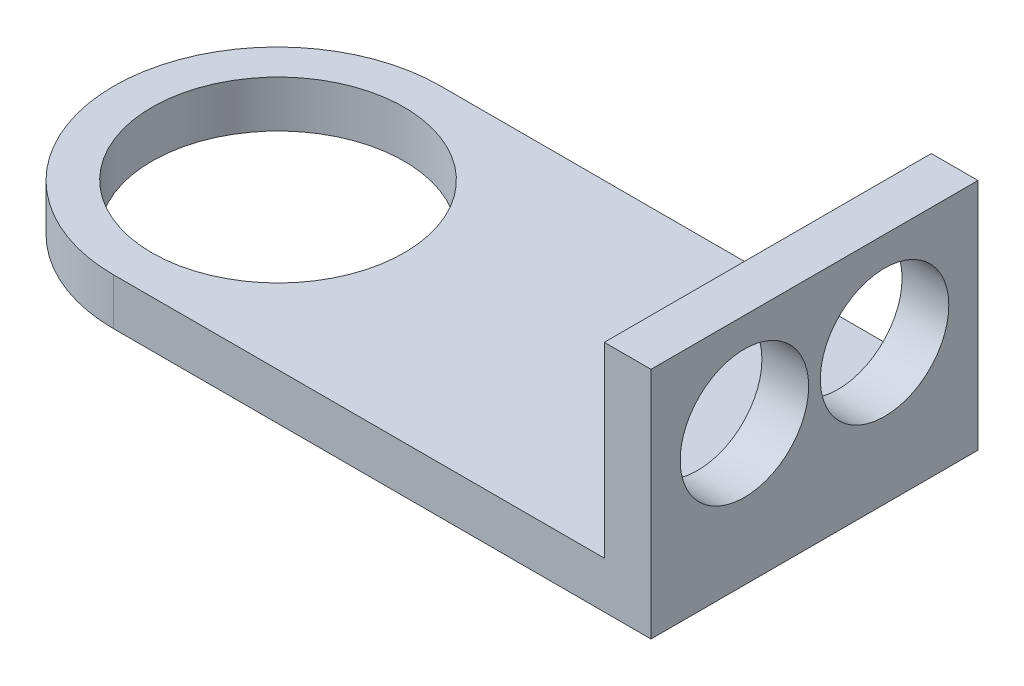
ISO-10303-21;
HEADER;
FILE_DESCRIPTION(('STEP AP214'),'2;1');
FILE_NAME('part.step','',(''),(''),'','','');
FILE_SCHEMA(('AUTOMOTIVE_DESIGN { 1 0 10303 214 1 1 1 1 }'));
ENDSEC;
DATA;
#1=APPLICATION_CONTEXT('core data for automotive mechanical design processes');
#2=APPLICATION_PROTOCOL_DEFINITION('international standard','automotive_design',2000,#1);
#3=PRODUCT_CONTEXT('',#1,'mechanical');
#4=PRODUCT('Part','Part','',(#3));
#5=PRODUCT_RELATED_PRODUCT_CATEGORY('part','',(#4));
#6=PRODUCT_DEFINITION_FORMATION('','',#4);
#7=PRODUCT_DEFINITION_CONTEXT('part definition',#1,'design');
#8=PRODUCT_DEFINITION('design','',#6,#7);
#9=PRODUCT_DEFINITION_SHAPE('','',#8);
#10=(LENGTH_UNIT() NAMED_UNIT(*) SI_UNIT(.MILLI.,.METRE.));
#11=(NAMED_UNIT(*) PLANE_ANGLE_UNIT() SI_UNIT($,.RADIAN.));
#12=(NAMED_UNIT(*) SI_UNIT($,.STERADIAN.) SOLID_ANGLE_UNIT());
#13=UNCERTAINTY_MEASURE_WITH_UNIT(LENGTH_MEASURE(1.E-05),#10,'distance_accuracy_value','');
#14=(GEOMETRIC_REPRESENTATION_CONTEXT(3) GLOBAL_UNCERTAINTY_ASSIGNED_CONTEXT((#13)) GLOBAL_UNIT_ASSIGNED_CONTEXT((#10,
#11,#12)) REPRESENTATION_CONTEXT('',''));
#15=CARTESIAN_POINT('',(0.,0.,0.));
#16=DIRECTION('',(0.,0.,1.));
#17=DIRECTION('',(1.,0.,0.));
#18=AXIS2_PLACEMENT_3D('',#15,#16,#17);
#19=CARTESIAN_POINT('',(-11.5,1.,-3.5));
#20=DIRECTION('',(0.,-1.,0.));
#21=DIRECTION('',(0.,0.,-1.));
#22=AXIS2_PLACEMENT_3D('',#19,#20,#21);
#23=CYLINDRICAL_SURFACE('',#22,3.5);
#24=DIRECTION('',(0.,-1.,0.));
#25=VECTOR('',#24,1.);
#26=CARTESIAN_POINT('',(-11.5,1.,0.));
#27=LINE('',#26,#25);
#28=CARTESIAN_POINT('',(-11.5,1.,0.));
#29=VERTEX_POINT('',#28);
#30=CARTESIAN_POINT('',(-11.5,0.,0.));
#31=VERTEX_POINT('',#30);
#32=EDGE_CURVE('E141',#29,#31,#27,.T.);
#33=ORIENTED_EDGE('',*,*,#32,.F.);
#34=CARTESIAN_POINT('',(-11.5,1.,-3.5));
#35=DIRECTION('',(0.,1.,0.));
#36=DIRECTION('',(0.,0.,1.));
#37=AXIS2_PLACEMENT_3D('',#34,#35,#36);
#38=CIRCLE('',#37,3.5);
#39=CARTESIAN_POINT('',(-11.5,1.,-7.));
#40=VERTEX_POINT('',#39);
#41=EDGE_CURVE('E44',#40,#29,#38,.T.);
#42=ORIENTED_EDGE('',*,*,#41,.F.);
#43=DIRECTION('',(0.,-1.,0.));
#44=VECTOR('',#43,1.);
#45=CARTESIAN_POINT('',(-11.5,1.,-7.));
#46=LINE('',#45,#44);
#47=CARTESIAN_POINT('',(-11.5,0.,-7.));
#48=VERTEX_POINT('',#47);
#49=EDGE_CURVE('E144',#48,#40,#46,.F.);
#50=ORIENTED_EDGE('',*,*,#49,.F.);
#51=CARTESIAN_POINT('',(-11.5,0.,-3.5));
#52=DIRECTION('',(0.,1.,0.));
#53=DIRECTION('',(0.,0.,1.));
#54=AXIS2_PLACEMENT_3D('',#51,#52,#53);
#55=CIRCLE('',#54,3.5);
#56=EDGE_CURVE('E11',#31,#48,#55,.F.);
#57=ORIENTED_EDGE('',*,*,#56,.F.);
#58=EDGE_LOOP('',(#33,#42,#50,#57));
#59=FACE_BOUND('',#58,.T.);
#60=ADVANCED_FACE('F35',(#59),#23,.T.);
#61=CARTESIAN_POINT('',(-15.,1.,0.));
#62=DIRECTION('',(0.,0.,-1.));
#63=DIRECTION('',(-1.,0.,0.));
#64=AXIS2_PLACEMENT_3D('',#61,#62,#63);
#65=PLANE('',#64);
#66=DIRECTION('',(1.,0.,0.));
#67=VECTOR('',#66,1.);
#68=CARTESIAN_POINT('',(-15.,1.,0.));
#69=LINE('',#68,#67);
#70=CARTESIAN_POINT('',(-1.,1.,0.));
#71=VERTEX_POINT('',#70);
#72=EDGE_CURVE('E133',#29,#71,#69,.T.);
#73=ORIENTED_EDGE('',*,*,#72,.F.);
#74=ORIENTED_EDGE('',*,*,#32,.T.);
#75=DIRECTION('',(1.,0.,0.));
#76=VECTOR('',#75,1.);
#77=CARTESIAN_POINT('',(-15.,0.,0.));
#78=LINE('',#77,#76);
#79=CARTESIAN_POINT('',(0.,0.,0.));
#80=VERTEX_POINT('',#79);
#81=EDGE_CURVE('E130',#31,#80,#78,.T.);
#82=ORIENTED_EDGE('',*,*,#81,.T.);
#83=DIRECTION('',(0.,-1.,0.));
#84=VECTOR('',#83,1.);
#85=CARTESIAN_POINT('',(0.,1.,0.));
#86=LINE('',#85,#84);
#87=CARTESIAN_POINT('',(0.,5.,0.));
#88=VERTEX_POINT('',#87);
#89=EDGE_CURVE('E98',#88,#80,#86,.T.);
#90=ORIENTED_EDGE('',*,*,#89,.F.);
#91=DIRECTION('',(1.,0.,0.));
#92=VECTOR('',#91,1.);
#93=CARTESIAN_POINT('',(0.,5.,0.));
#94=LINE('',#93,#92);
#95=CARTESIAN_POINT('',(-1.,5.,0.));
#96=VERTEX_POINT('',#95);
#97=EDGE_CURVE('E112',#96,#88,#94,.T.);
#98=ORIENTED_EDGE('',*,*,#97,.F.);
#99=DIRECTION('',(0.,-1.,0.));
#100=VECTOR('',#99,1.);
#101=CARTESIAN_POINT('',(-1.,5.,0.));
#102=LINE('',#101,#100);
#103=EDGE_CURVE('E121',#96,#71,#102,.T.);
#104=ORIENTED_EDGE('',*,*,#103,.T.);
#105=EDGE_LOOP('',(#73,#74,#82,#90,#98,#104));
#106=FACE_BOUND('',#105,.T.);
#107=ADVANCED_FACE('F165',(#106),#65,.F.);
#108=CARTESIAN_POINT('',(0.,1.,-7.));
#109=DIRECTION('',(-1.,0.,0.));
#110=DIRECTION('',(0.,0.,1.));
#111=AXIS2_PLACEMENT_3D('',#108,#109,#110);
#112=PLANE('',#111);
#113=CARTESIAN_POINT('',(0.,3.,-5.));
#114=DIRECTION('',(1.,0.,0.));
#115=DIRECTION('',(0.,0.,-1.));
#116=AXIS2_PLACEMENT_3D('',#113,#114,#115);
#117=CIRCLE('',#116,1.375);
#118=CARTESIAN_POINT('',(0.,3.,-6.375));
#119=VERTEX_POINT('',#118);
#120=EDGE_CURVE('E154',#119,#119,#117,.T.);
#121=ORIENTED_EDGE('',*,*,#120,.F.);
#122=EDGE_LOOP('',(#121));
#123=FACE_BOUND('',#122,.T.);
#124=CARTESIAN_POINT('',(0.,3.,-2.));
#125=DIRECTION('',(1.,0.,0.));
#126=DIRECTION('',(0.,0.,-1.));
#127=AXIS2_PLACEMENT_3D('',#124,#125,#126);
#128=CIRCLE('',#127,1.375);
#129=CARTESIAN_POINT('',(0.,3.,-3.375));
#130=VERTEX_POINT('',#129);
#131=EDGE_CURVE('E117',#130,#130,#128,.T.);
#132=ORIENTED_EDGE('',*,*,#131,.F.);
#133=EDGE_LOOP('',(#132));
#134=FACE_BOUND('',#133,.T.);
#135=DIRECTION('',(0.,0.,-1.));
#136=VECTOR('',#135,1.);
#137=CARTESIAN_POINT('',(0.,0.,-7.));
#138=LINE('',#137,#136);
#139=CARTESIAN_POINT('',(0.,0.,-7.));
#140=VERTEX_POINT('',#139);
#141=EDGE_CURVE('E94',#80,#140,#138,.T.);
#142=ORIENTED_EDGE('',*,*,#141,.T.);
#143=DIRECTION('',(0.,-1.,0.));
#144=VECTOR('',#143,1.);
#145=CARTESIAN_POINT('',(0.,1.,-7.));
#146=LINE('',#145,#144);
#147=CARTESIAN_POINT('',(0.,5.,-7.));
#148=VERTEX_POINT('',#147);
#149=EDGE_CURVE('E87',#148,#140,#146,.T.);
#150=ORIENTED_EDGE('',*,*,#149,.F.);
#151=DIRECTION('',(0.,0.,-1.));
#152=VECTOR('',#151,1.);
#153=CARTESIAN_POINT('',(0.,5.,-7.));
#154=LINE('',#153,#152);
#155=EDGE_CURVE('E92',#88,#148,#154,.T.);
#156=ORIENTED_EDGE('',*,*,#155,.F.);
#157=ORIENTED_EDGE('',*,*,#89,.T.);
#158=EDGE_LOOP('',(#142,#150,#156,#157));
#159=FACE_BOUND('',#158,.T.);
#160=ADVANCED_FACE('F89',(#123,#134,#159),#112,.F.);
#161=CARTESIAN_POINT('',(-15.,1.,-7.));
#162=DIRECTION('',(0.,0.,1.));
#163=DIRECTION('',(1.,0.,0.));
#164=AXIS2_PLACEMENT_3D('',#161,#162,#163);
#165=PLANE('',#164);
#166=DIRECTION('',(-1.,0.,0.));
#167=VECTOR('',#166,1.);
#168=CARTESIAN_POINT('',(-15.,0.,-7.));
#169=LINE('',#168,#167);
#170=EDGE_CURVE('E135',#140,#48,#169,.T.);
#171=ORIENTED_EDGE('',*,*,#170,.T.);
#172=ORIENTED_EDGE('',*,*,#49,.T.);
#173=DIRECTION('',(-1.,0.,0.));
#174=VECTOR('',#173,1.);
#175=CARTESIAN_POINT('',(-15.,1.,-7.));
#176=LINE('',#175,#174);
#177=CARTESIAN_POINT('',(-1.,1.,-7.));
#178=VERTEX_POINT('',#177);
#179=EDGE_CURVE('E56',#178,#40,#176,.T.);
#180=ORIENTED_EDGE('',*,*,#179,.F.);
#181=DIRECTION('',(0.,-1.,0.));
#182=VECTOR('',#181,1.);
#183=CARTESIAN_POINT('',(-1.,5.,-7.));
#184=LINE('',#183,#182);
#185=CARTESIAN_POINT('',(-1.,5.,-7.));
#186=VERTEX_POINT('',#185);
#187=EDGE_CURVE('E104',#186,#178,#184,.T.);
#188=ORIENTED_EDGE('',*,*,#187,.F.);
#189=DIRECTION('',(-1.,0.,0.));
#190=VECTOR('',#189,1.);
#191=CARTESIAN_POINT('',(0.,5.,-7.));
#192=LINE('',#191,#190);
#193=EDGE_CURVE('E101',#148,#186,#192,.T.);
#194=ORIENTED_EDGE('',*,*,#193,.F.);
#195=ORIENTED_EDGE('',*,*,#149,.T.);
#196=EDGE_LOOP('',(#171,#172,#180,#188,#194,#195));
#197=FACE_BOUND('',#196,.T.);
#198=ADVANCED_FACE('F102',(#197),#165,.F.);
#199=CARTESIAN_POINT('',(0.,1.,0.));
#200=DIRECTION('',(0.,1.,0.));
#201=DIRECTION('',(0.,0.,1.));
#202=AXIS2_PLACEMENT_3D('',#199,#200,#201);
#203=PLANE('',#202);
#204=DIRECTION('',(0.,0.,1.));
#205=VECTOR('',#204,1.);
#206=CARTESIAN_POINT('',(-1.,1.,-7.));
#207=LINE('',#206,#205);
#208=EDGE_CURVE('E52',#178,#71,#207,.T.);
#209=ORIENTED_EDGE('',*,*,#208,.F.);
#210=ORIENTED_EDGE('',*,*,#179,.T.);
#211=ORIENTED_EDGE('',*,*,#41,.T.);
#212=ORIENTED_EDGE('',*,*,#72,.T.);
#213=EDGE_LOOP('',(#209,#210,#211,#212));
#214=FACE_BOUND('',#213,.T.);
#215=CARTESIAN_POINT('',(-11.5,1.,-3.51724956271937));
#216=DIRECTION('',(0.,1.,0.));
#217=DIRECTION('',(0.,0.,1.));
#218=AXIS2_PLACEMENT_3D('',#215,#216,#217);
#219=CIRCLE('',#218,2.7);
#220=CARTESIAN_POINT('',(-11.5,1.,-0.81724956271937));
#221=VERTEX_POINT('',#220);
#222=EDGE_CURVE('E126',#221,#221,#219,.T.);
#223=ORIENTED_EDGE('',*,*,#222,.F.);
#224=EDGE_LOOP('',(#223));
#225=FACE_BOUND('',#224,.T.);
#226=ADVANCED_FACE('F171',(#214,#225),#203,.T.);
#227=CARTESIAN_POINT('',(0.,0.,0.));
#228=DIRECTION('',(0.,1.,0.));
#229=DIRECTION('',(0.,0.,1.));
#230=AXIS2_PLACEMENT_3D('',#227,#228,#229);
#231=PLANE('',#230);
#232=CARTESIAN_POINT('',(-11.5,0.,-3.51724956271937));
#233=DIRECTION('',(0.,1.,0.));
#234=DIRECTION('',(0.,0.,1.));
#235=AXIS2_PLACEMENT_3D('',#232,#233,#234);
#236=CIRCLE('',#235,2.7);
#237=CARTESIAN_POINT('',(-11.5,0.,-0.81724956271937));
#238=VERTEX_POINT('',#237);
#239=EDGE_CURVE('E127',#238,#238,#236,.T.);
#240=ORIENTED_EDGE('',*,*,#239,.T.);
#241=EDGE_LOOP('',(#240));
#242=FACE_BOUND('',#241,.T.);
#243=ORIENTED_EDGE('',*,*,#81,.F.);
#244=ORIENTED_EDGE('',*,*,#56,.T.);
#245=ORIENTED_EDGE('',*,*,#170,.F.);
#246=ORIENTED_EDGE('',*,*,#141,.F.);
#247=EDGE_LOOP('',(#243,#244,#245,#246));
#248=FACE_BOUND('',#247,.T.);
#249=ADVANCED_FACE('F188',(#242,#248),#231,.F.);
#250=CARTESIAN_POINT('',(-11.5,0.,-3.51724956271937));
#251=DIRECTION('',(0.,1.,0.));
#252=DIRECTION('',(0.,0.,1.));
#253=AXIS2_PLACEMENT_3D('',#250,#251,#252);
#254=CYLINDRICAL_SURFACE('',#253,2.7);
#255=ORIENTED_EDGE('',*,*,#239,.F.);
#256=EDGE_LOOP('',(#255));
#257=FACE_BOUND('',#256,.T.);
#258=ORIENTED_EDGE('',*,*,#222,.T.);
#259=EDGE_LOOP('',(#258));
#260=FACE_BOUND('',#259,.T.);
#261=ADVANCED_FACE('F190',(#257,#260),#254,.F.);
#262=CARTESIAN_POINT('',(-1.,5.,-7.));
#263=DIRECTION('',(1.,0.,0.));
#264=DIRECTION('',(0.,0.,-1.));
#265=AXIS2_PLACEMENT_3D('',#262,#263,#264);
#266=PLANE('',#265);
#267=CARTESIAN_POINT('',(-1.,3.,-5.));
#268=DIRECTION('',(1.,0.,0.));
#269=DIRECTION('',(0.,0.,-1.));
#270=AXIS2_PLACEMENT_3D('',#267,#268,#269);
#271=CIRCLE('',#270,1.375);
#272=CARTESIAN_POINT('',(-1.,3.,-6.375));
#273=VERTEX_POINT('',#272);
#274=EDGE_CURVE('E39',#273,#273,#271,.T.);
#275=ORIENTED_EDGE('',*,*,#274,.T.);
#276=EDGE_LOOP('',(#275));
#277=FACE_BOUND('',#276,.T.);
#278=CARTESIAN_POINT('',(-1.,3.,-2.));
#279=DIRECTION('',(1.,0.,0.));
#280=DIRECTION('',(0.,0.,-1.));
#281=AXIS2_PLACEMENT_3D('',#278,#279,#280);
#282=CIRCLE('',#281,1.375);
#283=CARTESIAN_POINT('',(-1.,3.,-3.375));
#284=VERTEX_POINT('',#283);
#285=EDGE_CURVE('E114',#284,#284,#282,.T.);
#286=ORIENTED_EDGE('',*,*,#285,.T.);
#287=EDGE_LOOP('',(#286));
#288=FACE_BOUND('',#287,.T.);
#289=ORIENTED_EDGE('',*,*,#208,.T.);
#290=ORIENTED_EDGE('',*,*,#103,.F.);
#291=DIRECTION('',(0.,0.,1.));
#292=VECTOR('',#291,1.);
#293=CARTESIAN_POINT('',(-1.,5.,-7.));
#294=LINE('',#293,#292);
#295=EDGE_CURVE('E107',#186,#96,#294,.T.);
#296=ORIENTED_EDGE('',*,*,#295,.F.);
#297=ORIENTED_EDGE('',*,*,#187,.T.);
#298=EDGE_LOOP('',(#289,#290,#296,#297));
#299=FACE_BOUND('',#298,.T.);
#300=ADVANCED_FACE('F186',(#277,#288,#299),#266,.F.);
#301=CARTESIAN_POINT('',(0.,5.,0.));
#302=DIRECTION('',(0.,-1.,0.));
#303=DIRECTION('',(0.,0.,-1.));
#304=AXIS2_PLACEMENT_3D('',#301,#302,#303);
#305=PLANE('',#304);
#306=ORIENTED_EDGE('',*,*,#155,.T.);
#307=ORIENTED_EDGE('',*,*,#193,.T.);
#308=ORIENTED_EDGE('',*,*,#295,.T.);
#309=ORIENTED_EDGE('',*,*,#97,.T.);
#310=EDGE_LOOP('',(#306,#307,#308,#309));
#311=FACE_BOUND('',#310,.T.);
#312=ADVANCED_FACE('F110',(#311),#305,.F.);
#313=CARTESIAN_POINT('',(-4.,3.,-2.));
#314=DIRECTION('',(1.,0.,0.));
#315=DIRECTION('',(0.,0.,-1.));
#316=AXIS2_PLACEMENT_3D('',#313,#314,#315);
#317=CYLINDRICAL_SURFACE('',#316,1.375);
#318=ORIENTED_EDGE('',*,*,#131,.T.);
#319=EDGE_LOOP('',(#318));
#320=FACE_BOUND('',#319,.T.);
#321=ORIENTED_EDGE('',*,*,#285,.F.);
#322=EDGE_LOOP('',(#321));
#323=FACE_BOUND('',#322,.T.);
#324=ADVANCED_FACE('F205',(#320,#323),#317,.F.);
#325=CARTESIAN_POINT('',(-4.,3.,-5.));
#326=DIRECTION('',(1.,0.,0.));
#327=DIRECTION('',(0.,0.,-1.));
#328=AXIS2_PLACEMENT_3D('',#325,#326,#327);
#329=CYLINDRICAL_SURFACE('',#328,1.375);
#330=ORIENTED_EDGE('',*,*,#120,.T.);
#331=EDGE_LOOP('',(#330));
#332=FACE_BOUND('',#331,.T.);
#333=ORIENTED_EDGE('',*,*,#274,.F.);
#334=EDGE_LOOP('',(#333));
#335=FACE_BOUND('',#334,.T.);
#336=ADVANCED_FACE('F160',(#332,#335),#329,.F.);
#337=CLOSED_SHELL('',(#60,#107,#160,#198,#226,#249,#261,#300,#312,#324,#336));
#338=MANIFOLD_SOLID_BREP('B2',#337);
#339=ADVANCED_BREP_SHAPE_REPRESENTATION('',(#18,#338),#14);
#340=SHAPE_DEFINITION_REPRESENTATION(#9,#339);
ENDSEC;
END-ISO-10303-21;
